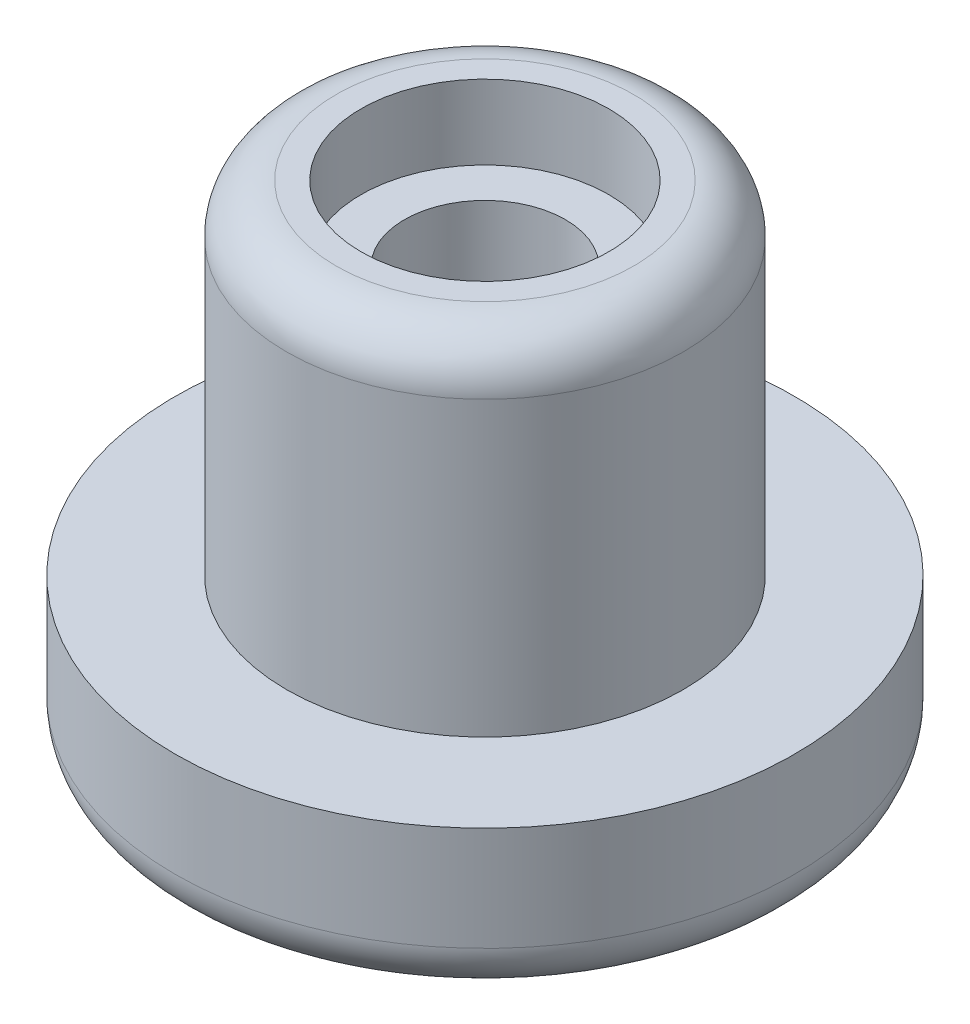
ISO-10303-21;
HEADER;
FILE_DESCRIPTION(('STEP AP214'),'2;1');
FILE_NAME('part.step','',(''),(''),'','','');
FILE_SCHEMA(('AUTOMOTIVE_DESIGN { 1 0 10303 214 1 1 1 1 }'));
ENDSEC;
DATA;
#1=APPLICATION_CONTEXT('core data for automotive mechanical design processes');
#2=APPLICATION_PROTOCOL_DEFINITION('international standard','automotive_design',2000,#1);
#3=PRODUCT_CONTEXT('',#1,'mechanical');
#4=PRODUCT('Part','Part','',(#3));
#5=PRODUCT_RELATED_PRODUCT_CATEGORY('part','',(#4));
#6=PRODUCT_DEFINITION_FORMATION('','',#4);
#7=PRODUCT_DEFINITION_CONTEXT('part definition',#1,'design');
#8=PRODUCT_DEFINITION('design','',#6,#7);
#9=PRODUCT_DEFINITION_SHAPE('','',#8);
#10=(LENGTH_UNIT() NAMED_UNIT(*) SI_UNIT(.MILLI.,.METRE.));
#11=(NAMED_UNIT(*) PLANE_ANGLE_UNIT() SI_UNIT($,.RADIAN.));
#12=(NAMED_UNIT(*) SI_UNIT($,.STERADIAN.) SOLID_ANGLE_UNIT());
#13=UNCERTAINTY_MEASURE_WITH_UNIT(LENGTH_MEASURE(1.E-05),#10,'distance_accuracy_value','');
#14=(GEOMETRIC_REPRESENTATION_CONTEXT(3) GLOBAL_UNCERTAINTY_ASSIGNED_CONTEXT((#13)) GLOBAL_UNIT_ASSIGNED_CONTEXT((#10,
#11,#12)) REPRESENTATION_CONTEXT('',''));
#15=CARTESIAN_POINT('',(0.,0.,0.));
#16=DIRECTION('',(0.,0.,1.));
#17=DIRECTION('',(1.,0.,0.));
#18=AXIS2_PLACEMENT_3D('',#15,#16,#17);
#19=CARTESIAN_POINT('',(0.,43.18,0.));
#20=DIRECTION('',(0.,-1.,0.));
#21=DIRECTION('',(0.,0.,-1.));
#22=AXIS2_PLACEMENT_3D('',#19,#20,#21);
#23=CYLINDRICAL_SURFACE('',#22,12.7);
#24=CARTESIAN_POINT('',(0.,43.18,0.));
#25=DIRECTION('',(0.,-1.,0.));
#26=DIRECTION('',(0.,0.,-1.));
#27=AXIS2_PLACEMENT_3D('',#24,#25,#26);
#28=CIRCLE('',#27,12.7);
#29=CARTESIAN_POINT('',(0.,43.18,-12.7));
#30=VERTEX_POINT('',#29);
#31=EDGE_CURVE('E11',#30,#30,#28,.T.);
#32=ORIENTED_EDGE('',*,*,#31,.T.);
#33=EDGE_LOOP('',(#32));
#34=FACE_BOUND('',#33,.T.);
#35=CARTESIAN_POINT('',(0.,0.,0.));
#36=DIRECTION('',(0.,-1.,0.));
#37=DIRECTION('',(0.,0.,-1.));
#38=AXIS2_PLACEMENT_3D('',#35,#36,#37);
#39=CIRCLE('',#38,12.7);
#40=CARTESIAN_POINT('',(0.,0.,-12.7));
#41=VERTEX_POINT('',#40);
#42=EDGE_CURVE('E52',#41,#41,#39,.T.);
#43=ORIENTED_EDGE('',*,*,#42,.F.);
#44=EDGE_LOOP('',(#43));
#45=FACE_BOUND('',#44,.T.);
#46=ADVANCED_FACE('F49',(#34,#45),#23,.T.);
#47=CARTESIAN_POINT('',(0.,43.18,0.));
#48=DIRECTION('',(0.,-1.,0.));
#49=DIRECTION('',(0.,0.,-1.));
#50=AXIS2_PLACEMENT_3D('',#47,#48,#49);
#51=PLANE('',#50);
#52=CARTESIAN_POINT('',(0.,43.18,0.));
#53=DIRECTION('',(0.,-1.,0.));
#54=DIRECTION('',(0.,0.,-1.));
#55=AXIS2_PLACEMENT_3D('',#52,#53,#54);
#56=CIRCLE('',#55,8.255);
#57=CARTESIAN_POINT('',(0.,43.18,-8.255));
#58=VERTEX_POINT('',#57);
#59=EDGE_CURVE('E59',#58,#58,#56,.T.);
#60=ORIENTED_EDGE('',*,*,#59,.T.);
#61=EDGE_LOOP('',(#60));
#62=FACE_BOUND('',#61,.T.);
#63=ORIENTED_EDGE('',*,*,#31,.F.);
#64=EDGE_LOOP('',(#63));
#65=FACE_BOUND('',#64,.T.);
#66=ADVANCED_FACE('F67',(#62,#65),#51,.F.);
#67=CARTESIAN_POINT('',(0.,0.,0.));
#68=DIRECTION('',(0.,-1.,0.));
#69=DIRECTION('',(0.,0.,-1.));
#70=AXIS2_PLACEMENT_3D('',#67,#68,#69);
#71=PLANE('',#70);
#72=CARTESIAN_POINT('',(0.,0.,0.));
#73=DIRECTION('',(0.,-1.,0.));
#74=DIRECTION('',(0.,0.,-1.));
#75=AXIS2_PLACEMENT_3D('',#72,#73,#74);
#76=CIRCLE('',#75,8.255);
#77=CARTESIAN_POINT('',(0.,0.,-8.255));
#78=VERTEX_POINT('',#77);
#79=EDGE_CURVE('E61',#78,#78,#76,.T.);
#80=ORIENTED_EDGE('',*,*,#79,.F.);
#81=EDGE_LOOP('',(#80));
#82=FACE_BOUND('',#81,.T.);
#83=ORIENTED_EDGE('',*,*,#42,.T.);
#84=EDGE_LOOP('',(#83));
#85=FACE_BOUND('',#84,.T.);
#86=ADVANCED_FACE('F73',(#82,#85),#71,.T.);
#87=CARTESIAN_POINT('',(0.,43.18,0.));
#88=DIRECTION('',(0.,-1.,0.));
#89=DIRECTION('',(0.,0.,-1.));
#90=AXIS2_PLACEMENT_3D('',#87,#88,#89);
#91=CYLINDRICAL_SURFACE('',#90,8.255);
#92=ORIENTED_EDGE('',*,*,#59,.F.);
#93=EDGE_LOOP('',(#92));
#94=FACE_BOUND('',#93,.T.);
#95=ORIENTED_EDGE('',*,*,#79,.T.);
#96=EDGE_LOOP('',(#95));
#97=FACE_BOUND('',#96,.T.);
#98=ADVANCED_FACE('F70',(#94,#97),#91,.F.);
#99=CLOSED_SHELL('',(#46,#66,#86,#98));
#100=MANIFOLD_SOLID_BREP('B2',#99);
#101=CARTESIAN_POINT('',(0.,15.748,0.));
#102=DIRECTION('',(0.,1.,0.));
#103=DIRECTION('',(0.,0.,1.));
#104=AXIS2_PLACEMENT_3D('',#101,#102,#103);
#105=PLANE('',#104);
#106=CARTESIAN_POINT('',(0.,15.748,0.));
#107=DIRECTION('',(0.,1.,0.));
#108=DIRECTION('',(0.,0.,1.));
#109=AXIS2_PLACEMENT_3D('',#106,#107,#108);
#110=CIRCLE('',#109,31.75);
#111=CARTESIAN_POINT('',(0.,15.748,31.75));
#112=VERTEX_POINT('',#111);
#113=EDGE_CURVE('E131',#112,#112,#110,.T.);
#114=ORIENTED_EDGE('',*,*,#113,.T.);
#115=EDGE_LOOP('',(#114));
#116=FACE_BOUND('',#115,.T.);
#117=CARTESIAN_POINT('',(0.,15.748,0.));
#118=DIRECTION('',(0.,1.,0.));
#119=DIRECTION('',(0.,0.,1.));
#120=AXIS2_PLACEMENT_3D('',#117,#118,#119);
#121=CIRCLE('',#120,20.32);
#122=CARTESIAN_POINT('',(0.,15.748,20.32));
#123=VERTEX_POINT('',#122);
#124=EDGE_CURVE('E137',#123,#123,#121,.T.);
#125=ORIENTED_EDGE('',*,*,#124,.F.);
#126=EDGE_LOOP('',(#125));
#127=FACE_BOUND('',#126,.T.);
#128=ADVANCED_FACE('F111',(#116,#127),#105,.T.);
#129=CARTESIAN_POINT('',(0.,0.,0.));
#130=DIRECTION('',(0.,1.,0.));
#131=DIRECTION('',(0.,0.,1.));
#132=AXIS2_PLACEMENT_3D('',#129,#130,#131);
#133=PLANE('',#132);
#134=CARTESIAN_POINT('',(0.,0.,0.));
#135=DIRECTION('',(0.,1.,0.));
#136=DIRECTION('',(0.,0.,1.));
#137=AXIS2_PLACEMENT_3D('',#134,#135,#136);
#138=CIRCLE('',#137,26.67);
#139=CARTESIAN_POINT('',(0.,0.,26.67));
#140=VERTEX_POINT('',#139);
#141=EDGE_CURVE('E122',#140,#140,#138,.F.);
#142=ORIENTED_EDGE('',*,*,#141,.T.);
#143=EDGE_LOOP('',(#142));
#144=FACE_BOUND('',#143,.T.);
#145=CARTESIAN_POINT('',(0.,0.,0.));
#146=DIRECTION('',(0.,1.,0.));
#147=DIRECTION('',(0.,0.,1.));
#148=AXIS2_PLACEMENT_3D('',#145,#146,#147);
#149=CIRCLE('',#148,12.7);
#150=CARTESIAN_POINT('',(0.,0.,12.7));
#151=VERTEX_POINT('',#150);
#152=EDGE_CURVE('E134',#151,#151,#149,.T.);
#153=ORIENTED_EDGE('',*,*,#152,.T.);
#154=EDGE_LOOP('',(#153));
#155=FACE_BOUND('',#154,.T.);
#156=ADVANCED_FACE('F161',(#144,#155),#133,.F.);
#157=CARTESIAN_POINT('',(0.,15.748,0.));
#158=DIRECTION('',(0.,-1.,0.));
#159=DIRECTION('',(0.,0.,-1.));
#160=AXIS2_PLACEMENT_3D('',#157,#158,#159);
#161=CYLINDRICAL_SURFACE('',#160,31.75);
#162=CARTESIAN_POINT('',(0.,5.08,0.));
#163=DIRECTION('',(0.,1.,0.));
#164=DIRECTION('',(0.,0.,1.));
#165=AXIS2_PLACEMENT_3D('',#162,#163,#164);
#166=CIRCLE('',#165,31.75);
#167=CARTESIAN_POINT('',(0.,5.08,31.75));
#168=VERTEX_POINT('',#167);
#169=EDGE_CURVE('E126',#168,#168,#166,.T.);
#170=ORIENTED_EDGE('',*,*,#169,.T.);
#171=EDGE_LOOP('',(#170));
#172=FACE_BOUND('',#171,.T.);
#173=ORIENTED_EDGE('',*,*,#113,.F.);
#174=EDGE_LOOP('',(#173));
#175=FACE_BOUND('',#174,.T.);
#176=ADVANCED_FACE('F157',(#172,#175),#161,.T.);
#177=CARTESIAN_POINT('',(0.,15.748,0.));
#178=DIRECTION('',(0.,-1.,0.));
#179=DIRECTION('',(0.,0.,-1.));
#180=AXIS2_PLACEMENT_3D('',#177,#178,#179);
#181=CYLINDRICAL_SURFACE('',#180,12.7);
#182=ORIENTED_EDGE('',*,*,#152,.F.);
#183=EDGE_LOOP('',(#182));
#184=FACE_BOUND('',#183,.T.);
#185=CARTESIAN_POINT('',(0.,50.8,0.));
#186=DIRECTION('',(0.,1.,0.));
#187=DIRECTION('',(0.,0.,1.));
#188=AXIS2_PLACEMENT_3D('',#185,#186,#187);
#189=CIRCLE('',#188,12.7);
#190=CARTESIAN_POINT('',(0.,50.8,12.7));
#191=VERTEX_POINT('',#190);
#192=EDGE_CURVE('E140',#191,#191,#189,.T.);
#193=ORIENTED_EDGE('',*,*,#192,.T.);
#194=EDGE_LOOP('',(#193));
#195=FACE_BOUND('',#194,.T.);
#196=ADVANCED_FACE('F144',(#184,#195),#181,.F.);
#197=CARTESIAN_POINT('',(0.,50.8,0.));
#198=DIRECTION('',(0.,1.,0.));
#199=DIRECTION('',(0.,0.,1.));
#200=AXIS2_PLACEMENT_3D('',#197,#198,#199);
#201=PLANE('',#200);
#202=CARTESIAN_POINT('',(0.,50.8,0.));
#203=DIRECTION('',(0.,1.,0.));
#204=DIRECTION('',(0.,0.,1.));
#205=AXIS2_PLACEMENT_3D('',#202,#203,#204);
#206=CIRCLE('',#205,15.24);
#207=CARTESIAN_POINT('',(0.,50.8,15.24));
#208=VERTEX_POINT('',#207);
#209=EDGE_CURVE('E118',#208,#208,#206,.T.);
#210=ORIENTED_EDGE('',*,*,#209,.T.);
#211=EDGE_LOOP('',(#210));
#212=FACE_BOUND('',#211,.T.);
#213=ORIENTED_EDGE('',*,*,#192,.F.);
#214=EDGE_LOOP('',(#213));
#215=FACE_BOUND('',#214,.T.);
#216=ADVANCED_FACE('F146',(#212,#215),#201,.T.);
#217=CARTESIAN_POINT('',(0.,50.8,0.));
#218=DIRECTION('',(0.,-1.,0.));
#219=DIRECTION('',(0.,0.,-1.));
#220=AXIS2_PLACEMENT_3D('',#217,#218,#219);
#221=CYLINDRICAL_SURFACE('',#220,20.32);
#222=CARTESIAN_POINT('',(0.,45.72,0.));
#223=DIRECTION('',(0.,1.,0.));
#224=DIRECTION('',(0.,0.,1.));
#225=AXIS2_PLACEMENT_3D('',#222,#223,#224);
#226=CIRCLE('',#225,20.32);
#227=CARTESIAN_POINT('',(0.,45.72,20.32));
#228=VERTEX_POINT('',#227);
#229=EDGE_CURVE('E48',#228,#228,#226,.F.);
#230=ORIENTED_EDGE('',*,*,#229,.T.);
#231=EDGE_LOOP('',(#230));
#232=FACE_BOUND('',#231,.T.);
#233=ORIENTED_EDGE('',*,*,#124,.T.);
#234=EDGE_LOOP('',(#233));
#235=FACE_BOUND('',#234,.T.);
#236=ADVANCED_FACE('F148',(#232,#235),#221,.T.);
#237=CARTESIAN_POINT('',(0.,5.08,0.));
#238=DIRECTION('',(0.,1.,0.));
#239=DIRECTION('',(0.,0.,1.));
#240=AXIS2_PLACEMENT_3D('',#237,#238,#239);
#241=TOROIDAL_SURFACE('',#240,26.67,5.08);
#242=ORIENTED_EDGE('',*,*,#141,.F.);
#243=EDGE_LOOP('',(#242));
#244=FACE_BOUND('',#243,.T.);
#245=ORIENTED_EDGE('',*,*,#169,.F.);
#246=EDGE_LOOP('',(#245));
#247=FACE_BOUND('',#246,.T.);
#248=ADVANCED_FACE('F154',(#244,#247),#241,.T.);
#249=CARTESIAN_POINT('',(0.,45.72,0.));
#250=DIRECTION('',(0.,1.,0.));
#251=DIRECTION('',(0.,0.,1.));
#252=AXIS2_PLACEMENT_3D('',#249,#250,#251);
#253=TOROIDAL_SURFACE('',#252,15.24,5.08);
#254=ORIENTED_EDGE('',*,*,#229,.F.);
#255=EDGE_LOOP('',(#254));
#256=FACE_BOUND('',#255,.T.);
#257=ORIENTED_EDGE('',*,*,#209,.F.);
#258=EDGE_LOOP('',(#257));
#259=FACE_BOUND('',#258,.T.);
#260=ADVANCED_FACE('F113',(#256,#259),#253,.T.);
#261=CLOSED_SHELL('',(#128,#156,#176,#196,#216,#236,#248,#260));
#262=MANIFOLD_SOLID_BREP('B6',#261);
#263=ADVANCED_BREP_SHAPE_REPRESENTATION('',(#18,#100,#262),#14);
#264=SHAPE_DEFINITION_REPRESENTATION(#9,#263);
ENDSEC;
END-ISO-10303-21;
